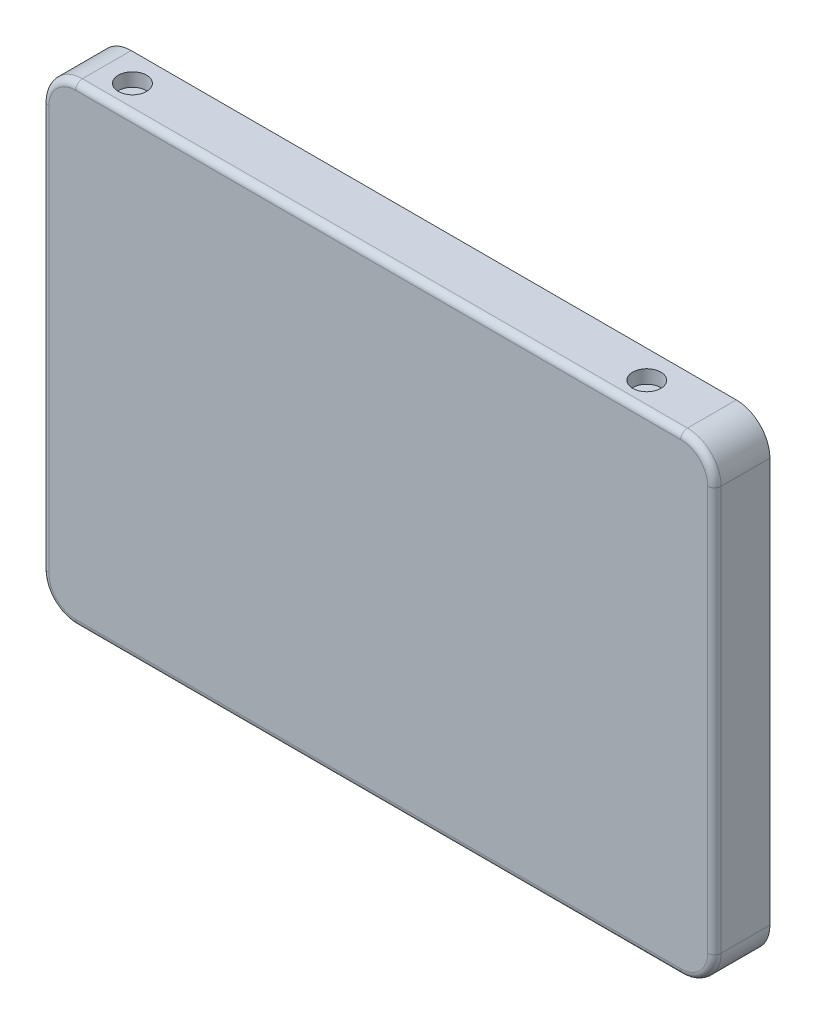
ISO-10303-21;
HEADER;
FILE_DESCRIPTION(('STEP AP214'),'2;1');
FILE_NAME('part.step','',(''),(''),'','','');
FILE_SCHEMA(('AUTOMOTIVE_DESIGN { 1 0 10303 214 1 1 1 1 }'));
ENDSEC;
DATA;
#1=APPLICATION_CONTEXT('core data for automotive mechanical design processes');
#2=APPLICATION_PROTOCOL_DEFINITION('international standard','automotive_design',2000,#1);
#3=PRODUCT_CONTEXT('',#1,'mechanical');
#4=PRODUCT('Part','Part','',(#3));
#5=PRODUCT_RELATED_PRODUCT_CATEGORY('part','',(#4));
#6=PRODUCT_DEFINITION_FORMATION('','',#4);
#7=PRODUCT_DEFINITION_CONTEXT('part definition',#1,'design');
#8=PRODUCT_DEFINITION('design','',#6,#7);
#9=PRODUCT_DEFINITION_SHAPE('','',#8);
#10=(LENGTH_UNIT() NAMED_UNIT(*) SI_UNIT(.MILLI.,.METRE.));
#11=(NAMED_UNIT(*) PLANE_ANGLE_UNIT() SI_UNIT($,.RADIAN.));
#12=(NAMED_UNIT(*) SI_UNIT($,.STERADIAN.) SOLID_ANGLE_UNIT());
#13=UNCERTAINTY_MEASURE_WITH_UNIT(LENGTH_MEASURE(1.E-05),#10,'distance_accuracy_value','');
#14=(GEOMETRIC_REPRESENTATION_CONTEXT(3) GLOBAL_UNCERTAINTY_ASSIGNED_CONTEXT((#13)) GLOBAL_UNIT_ASSIGNED_CONTEXT((#10,
#11,#12)) REPRESENTATION_CONTEXT('',''));
#15=CARTESIAN_POINT('',(0.,0.,0.));
#16=DIRECTION('',(0.,0.,1.));
#17=DIRECTION('',(1.,0.,0.));
#18=AXIS2_PLACEMENT_3D('',#15,#16,#17);
#19=CARTESIAN_POINT('',(0.,0.,0.));
#20=DIRECTION('',(0.,0.,1.));
#21=DIRECTION('',(1.,0.,0.));
#22=AXIS2_PLACEMENT_3D('',#19,#20,#21);
#23=PLANE('',#22);
#24=CARTESIAN_POINT('',(85.81,30.925,0.));
#25=DIRECTION('',(0.,0.,-1.));
#26=DIRECTION('',(-1.,0.,0.));
#27=AXIS2_PLACEMENT_3D('',#24,#25,#26);
#28=CIRCLE('',#27,2.);
#29=CARTESIAN_POINT('',(83.81,30.925,0.));
#30=VERTEX_POINT('',#29);
#31=EDGE_CURVE('E640',#30,#30,#28,.T.);
#32=ORIENTED_EDGE('',*,*,#31,.F.);
#33=EDGE_LOOP('',(#32));
#34=FACE_BOUND('',#33,.T.);
#35=CARTESIAN_POINT('',(9.31,-30.925,0.));
#36=DIRECTION('',(0.,0.,1.));
#37=DIRECTION('',(1.,0.,0.));
#38=AXIS2_PLACEMENT_3D('',#35,#36,#37);
#39=CIRCLE('',#38,2.);
#40=CARTESIAN_POINT('',(11.31,-30.925,0.));
#41=VERTEX_POINT('',#40);
#42=EDGE_CURVE('E233',#41,#41,#39,.T.);
#43=ORIENTED_EDGE('',*,*,#42,.T.);
#44=EDGE_LOOP('',(#43));
#45=FACE_BOUND('',#44,.T.);
#46=DIRECTION('',(0.,-1.,0.));
#47=VECTOR('',#46,1.);
#48=CARTESIAN_POINT('',(100.,35.075,0.));
#49=LINE('',#48,#47);
#50=CARTESIAN_POINT('',(100.,30.075,0.));
#51=VERTEX_POINT('',#50);
#52=CARTESIAN_POINT('',(100.,-30.075,0.));
#53=VERTEX_POINT('',#52);
#54=EDGE_CURVE('E128',#51,#53,#49,.T.);
#55=ORIENTED_EDGE('',*,*,#54,.T.);
#56=CARTESIAN_POINT('',(95.,-30.075,0.));
#57=DIRECTION('',(0.,0.,1.));
#58=DIRECTION('',(1.,0.,0.));
#59=AXIS2_PLACEMENT_3D('',#56,#57,#58);
#60=CIRCLE('',#59,5.);
#61=CARTESIAN_POINT('',(95.,-35.075,0.));
#62=VERTEX_POINT('',#61);
#63=EDGE_CURVE('E150',#53,#62,#60,.F.);
#64=ORIENTED_EDGE('',*,*,#63,.T.);
#65=DIRECTION('',(1.,0.,0.));
#66=VECTOR('',#65,1.);
#67=CARTESIAN_POINT('',(0.,-35.075,0.));
#68=LINE('',#67,#66);
#69=CARTESIAN_POINT('',(5.00000000000001,-35.075,0.));
#70=VERTEX_POINT('',#69);
#71=EDGE_CURVE('E141',#70,#62,#68,.T.);
#72=ORIENTED_EDGE('',*,*,#71,.F.);
#73=CARTESIAN_POINT('',(5.,-30.075,0.));
#74=DIRECTION('',(0.,0.,1.));
#75=DIRECTION('',(1.,0.,0.));
#76=AXIS2_PLACEMENT_3D('',#73,#74,#75);
#77=CIRCLE('',#76,5.);
#78=CARTESIAN_POINT('',(0.,-30.075,0.));
#79=VERTEX_POINT('',#78);
#80=EDGE_CURVE('E131',#70,#79,#77,.F.);
#81=ORIENTED_EDGE('',*,*,#80,.T.);
#82=DIRECTION('',(0.,-1.,0.));
#83=VECTOR('',#82,1.);
#84=CARTESIAN_POINT('',(0.,35.075,0.));
#85=LINE('',#84,#83);
#86=CARTESIAN_POINT('',(0.,30.075,0.));
#87=VERTEX_POINT('',#86);
#88=EDGE_CURVE('E251',#87,#79,#85,.T.);
#89=ORIENTED_EDGE('',*,*,#88,.F.);
#90=CARTESIAN_POINT('',(5.,30.075,0.));
#91=DIRECTION('',(0.,0.,1.));
#92=DIRECTION('',(1.,0.,0.));
#93=AXIS2_PLACEMENT_3D('',#90,#91,#92);
#94=CIRCLE('',#93,5.);
#95=CARTESIAN_POINT('',(5.,35.075,0.));
#96=VERTEX_POINT('',#95);
#97=EDGE_CURVE('E132',#87,#96,#94,.F.);
#98=ORIENTED_EDGE('',*,*,#97,.T.);
#99=DIRECTION('',(1.,0.,0.));
#100=VECTOR('',#99,1.);
#101=CARTESIAN_POINT('',(0.,35.075,0.));
#102=LINE('',#101,#100);
#103=CARTESIAN_POINT('',(95.,35.075,0.));
#104=VERTEX_POINT('',#103);
#105=EDGE_CURVE('E130',#96,#104,#102,.T.);
#106=ORIENTED_EDGE('',*,*,#105,.T.);
#107=CARTESIAN_POINT('',(95.,30.075,0.));
#108=DIRECTION('',(0.,0.,1.));
#109=DIRECTION('',(1.,0.,0.));
#110=AXIS2_PLACEMENT_3D('',#107,#108,#109);
#111=CIRCLE('',#110,5.);
#112=EDGE_CURVE('E125',#104,#51,#111,.F.);
#113=ORIENTED_EDGE('',*,*,#112,.T.);
#114=EDGE_LOOP('',(#55,#64,#72,#81,#89,#98,#106,#113));
#115=FACE_BOUND('',#114,.T.);
#116=CARTESIAN_POINT('',(9.31,30.925,0.));
#117=DIRECTION('',(0.,0.,1.));
#118=DIRECTION('',(1.,0.,0.));
#119=AXIS2_PLACEMENT_3D('',#116,#117,#118);
#120=CIRCLE('',#119,2.);
#121=CARTESIAN_POINT('',(11.31,30.925,0.));
#122=VERTEX_POINT('',#121);
#123=EDGE_CURVE('E652',#122,#122,#120,.T.);
#124=ORIENTED_EDGE('',*,*,#123,.T.);
#125=EDGE_LOOP('',(#124));
#126=FACE_BOUND('',#125,.T.);
#127=CARTESIAN_POINT('',(85.81,-30.925,0.));
#128=DIRECTION('',(0.,0.,-1.));
#129=DIRECTION('',(-1.,0.,0.));
#130=AXIS2_PLACEMENT_3D('',#127,#128,#129);
#131=CIRCLE('',#130,2.);
#132=CARTESIAN_POINT('',(83.81,-30.925,0.));
#133=VERTEX_POINT('',#132);
#134=EDGE_CURVE('E641',#133,#133,#131,.T.);
#135=ORIENTED_EDGE('',*,*,#134,.F.);
#136=EDGE_LOOP('',(#135));
#137=FACE_BOUND('',#136,.T.);
#138=ADVANCED_FACE('F34',(#34,#45,#115,#126,#137),#23,.F.);
#139=CARTESIAN_POINT('',(0.,35.075,8.25));
#140=DIRECTION('',(0.,1.,0.));
#141=DIRECTION('',(-1.,0.,0.));
#142=AXIS2_PLACEMENT_3D('',#139,#140,#141);
#143=PLANE('',#142);
#144=CARTESIAN_POINT('',(85.81,35.075,4.125));
#145=DIRECTION('',(0.,1.,0.));
#146=DIRECTION('',(-1.,0.,0.));
#147=AXIS2_PLACEMENT_3D('',#144,#145,#146);
#148=CIRCLE('',#147,2.1);
#149=CARTESIAN_POINT('',(83.71,35.075,4.125));
#150=VERTEX_POINT('',#149);
#151=EDGE_CURVE('E230',#150,#150,#148,.T.);
#152=ORIENTED_EDGE('',*,*,#151,.F.);
#153=EDGE_LOOP('',(#152));
#154=FACE_BOUND('',#153,.T.);
#155=DIRECTION('',(0.,0.,-1.));
#156=VECTOR('',#155,1.);
#157=CARTESIAN_POINT('',(5.,35.075,8.25));
#158=LINE('',#157,#156);
#159=CARTESIAN_POINT('',(5.,35.075,7.25));
#160=VERTEX_POINT('',#159);
#161=EDGE_CURVE('E162',#96,#160,#158,.F.);
#162=ORIENTED_EDGE('',*,*,#161,.T.);
#163=DIRECTION('',(1.,0.,0.));
#164=VECTOR('',#163,1.);
#165=CARTESIAN_POINT('',(0.,35.075,7.25));
#166=LINE('',#165,#164);
#167=CARTESIAN_POINT('',(95.,35.075,7.25));
#168=VERTEX_POINT('',#167);
#169=EDGE_CURVE('E11',#160,#168,#166,.T.);
#170=ORIENTED_EDGE('',*,*,#169,.T.);
#171=DIRECTION('',(0.,0.,-1.));
#172=VECTOR('',#171,1.);
#173=CARTESIAN_POINT('',(95.,35.075,8.25));
#174=LINE('',#173,#172);
#175=EDGE_CURVE('E164',#168,#104,#174,.T.);
#176=ORIENTED_EDGE('',*,*,#175,.T.);
#177=ORIENTED_EDGE('',*,*,#105,.F.);
#178=EDGE_LOOP('',(#162,#170,#176,#177));
#179=FACE_BOUND('',#178,.T.);
#180=CARTESIAN_POINT('',(9.31,35.075,4.125));
#181=DIRECTION('',(0.,1.,0.));
#182=DIRECTION('',(-1.,0.,0.));
#183=AXIS2_PLACEMENT_3D('',#180,#181,#182);
#184=CIRCLE('',#183,2.1);
#185=CARTESIAN_POINT('',(7.21,35.075,4.125));
#186=VERTEX_POINT('',#185);
#187=EDGE_CURVE('E220',#186,#186,#184,.T.);
#188=ORIENTED_EDGE('',*,*,#187,.F.);
#189=EDGE_LOOP('',(#188));
#190=FACE_BOUND('',#189,.T.);
#191=ADVANCED_FACE('F286',(#154,#179,#190),#143,.T.);
#192=CARTESIAN_POINT('',(0.,-35.075,8.25));
#193=DIRECTION('',(0.,1.,0.));
#194=DIRECTION('',(-1.,0.,0.));
#195=AXIS2_PLACEMENT_3D('',#192,#193,#194);
#196=PLANE('',#195);
#197=CARTESIAN_POINT('',(9.31,-35.075,4.125));
#198=DIRECTION('',(0.,1.,0.));
#199=DIRECTION('',(-1.,0.,0.));
#200=AXIS2_PLACEMENT_3D('',#197,#198,#199);
#201=CIRCLE('',#200,2.1);
#202=CARTESIAN_POINT('',(7.21,-35.075,4.125));
#203=VERTEX_POINT('',#202);
#204=EDGE_CURVE('E245',#203,#203,#201,.T.);
#205=ORIENTED_EDGE('',*,*,#204,.T.);
#206=EDGE_LOOP('',(#205));
#207=FACE_BOUND('',#206,.T.);
#208=DIRECTION('',(0.,0.,-1.));
#209=VECTOR('',#208,1.);
#210=CARTESIAN_POINT('',(95.,-35.075,8.25));
#211=LINE('',#210,#209);
#212=CARTESIAN_POINT('',(95.,-35.075,7.25));
#213=VERTEX_POINT('',#212);
#214=EDGE_CURVE('E154',#62,#213,#211,.F.);
#215=ORIENTED_EDGE('',*,*,#214,.T.);
#216=DIRECTION('',(1.,0.,0.));
#217=VECTOR('',#216,1.);
#218=CARTESIAN_POINT('',(5.00000000000001,-35.075,7.25));
#219=LINE('',#218,#217);
#220=CARTESIAN_POINT('',(5.00000000000001,-35.075,7.25));
#221=VERTEX_POINT('',#220);
#222=EDGE_CURVE('E190',#213,#221,#219,.F.);
#223=ORIENTED_EDGE('',*,*,#222,.T.);
#224=DIRECTION('',(0.,0.,-1.));
#225=VECTOR('',#224,1.);
#226=CARTESIAN_POINT('',(5.00000000000001,-35.075,8.25));
#227=LINE('',#226,#225);
#228=EDGE_CURVE('E152',#221,#70,#227,.T.);
#229=ORIENTED_EDGE('',*,*,#228,.T.);
#230=ORIENTED_EDGE('',*,*,#71,.T.);
#231=EDGE_LOOP('',(#215,#223,#229,#230));
#232=FACE_BOUND('',#231,.T.);
#233=CARTESIAN_POINT('',(85.81,-35.075,4.125));
#234=DIRECTION('',(0.,1.,0.));
#235=DIRECTION('',(-1.,0.,0.));
#236=AXIS2_PLACEMENT_3D('',#233,#234,#235);
#237=CIRCLE('',#236,2.1);
#238=CARTESIAN_POINT('',(83.71,-35.075,4.125));
#239=VERTEX_POINT('',#238);
#240=EDGE_CURVE('E242',#239,#239,#237,.T.);
#241=ORIENTED_EDGE('',*,*,#240,.T.);
#242=EDGE_LOOP('',(#241));
#243=FACE_BOUND('',#242,.T.);
#244=ADVANCED_FACE('F260',(#207,#232,#243),#196,.F.);
#245=CARTESIAN_POINT('',(0.,35.075,8.25));
#246=DIRECTION('',(1.,0.,0.));
#247=DIRECTION('',(0.,1.,0.));
#248=AXIS2_PLACEMENT_3D('',#245,#246,#247);
#249=PLANE('',#248);
#250=DIRECTION('',(0.,0.,-1.));
#251=VECTOR('',#250,1.);
#252=CARTESIAN_POINT('',(0.,-30.075,8.25));
#253=LINE('',#252,#251);
#254=CARTESIAN_POINT('',(0.,-30.075,7.25));
#255=VERTEX_POINT('',#254);
#256=EDGE_CURVE('E159',#79,#255,#253,.F.);
#257=ORIENTED_EDGE('',*,*,#256,.T.);
#258=DIRECTION('',(0.,-1.,0.));
#259=VECTOR('',#258,1.);
#260=CARTESIAN_POINT('',(0.,30.075,7.25));
#261=LINE('',#260,#259);
#262=CARTESIAN_POINT('',(0.,30.075,7.25));
#263=VERTEX_POINT('',#262);
#264=EDGE_CURVE('E186',#255,#263,#261,.F.);
#265=ORIENTED_EDGE('',*,*,#264,.T.);
#266=DIRECTION('',(0.,0.,-1.));
#267=VECTOR('',#266,1.);
#268=CARTESIAN_POINT('',(0.,30.075,0.));
#269=LINE('',#268,#267);
#270=EDGE_CURVE('E157',#263,#87,#269,.T.);
#271=ORIENTED_EDGE('',*,*,#270,.T.);
#272=ORIENTED_EDGE('',*,*,#88,.T.);
#273=EDGE_LOOP('',(#257,#265,#271,#272));
#274=FACE_BOUND('',#273,.T.);
#275=ADVANCED_FACE('F277',(#274),#249,.F.);
#276=CARTESIAN_POINT('',(100.,35.075,8.25));
#277=DIRECTION('',(1.,0.,0.));
#278=DIRECTION('',(0.,1.,0.));
#279=AXIS2_PLACEMENT_3D('',#276,#277,#278);
#280=PLANE('',#279);
#281=DIRECTION('',(0.,0.,-1.));
#282=VECTOR('',#281,1.);
#283=CARTESIAN_POINT('',(100.,30.075,8.25));
#284=LINE('',#283,#282);
#285=CARTESIAN_POINT('',(100.,30.075,7.25));
#286=VERTEX_POINT('',#285);
#287=EDGE_CURVE('E136',#51,#286,#284,.F.);
#288=ORIENTED_EDGE('',*,*,#287,.T.);
#289=DIRECTION('',(0.,-1.,0.));
#290=VECTOR('',#289,1.);
#291=CARTESIAN_POINT('',(100.,35.075,7.25));
#292=LINE('',#291,#290);
#293=CARTESIAN_POINT('',(100.,-30.075,7.25));
#294=VERTEX_POINT('',#293);
#295=EDGE_CURVE('E194',#286,#294,#292,.T.);
#296=ORIENTED_EDGE('',*,*,#295,.T.);
#297=DIRECTION('',(0.,0.,-1.));
#298=VECTOR('',#297,1.);
#299=CARTESIAN_POINT('',(100.,-30.075,0.));
#300=LINE('',#299,#298);
#301=EDGE_CURVE('E139',#294,#53,#300,.T.);
#302=ORIENTED_EDGE('',*,*,#301,.T.);
#303=ORIENTED_EDGE('',*,*,#54,.F.);
#304=EDGE_LOOP('',(#288,#296,#302,#303));
#305=FACE_BOUND('',#304,.T.);
#306=ADVANCED_FACE('F135',(#305),#280,.T.);
#307=CARTESIAN_POINT('',(0.,0.,8.25));
#308=DIRECTION('',(0.,0.,1.));
#309=DIRECTION('',(1.,0.,0.));
#310=AXIS2_PLACEMENT_3D('',#307,#308,#309);
#311=PLANE('',#310);
#312=DIRECTION('',(1.,0.,0.));
#313=VECTOR('',#312,1.);
#314=CARTESIAN_POINT('',(0.,34.075,8.25));
#315=LINE('',#314,#313);
#316=CARTESIAN_POINT('',(95.,34.075,8.25));
#317=VERTEX_POINT('',#316);
#318=CARTESIAN_POINT('',(5.,34.075,8.25));
#319=VERTEX_POINT('',#318);
#320=EDGE_CURVE('E166',#317,#319,#315,.F.);
#321=ORIENTED_EDGE('',*,*,#320,.T.);
#322=CARTESIAN_POINT('',(5.,30.075,8.25));
#323=DIRECTION('',(0.,0.,1.));
#324=DIRECTION('',(1.,0.,0.));
#325=AXIS2_PLACEMENT_3D('',#322,#323,#324);
#326=CIRCLE('',#325,4.);
#327=CARTESIAN_POINT('',(1.,30.075,8.25));
#328=VERTEX_POINT('',#327);
#329=EDGE_CURVE('E180',#319,#328,#326,.T.);
#330=ORIENTED_EDGE('',*,*,#329,.T.);
#331=DIRECTION('',(0.,-1.,0.));
#332=VECTOR('',#331,1.);
#333=CARTESIAN_POINT('',(1.,-30.075,8.25));
#334=LINE('',#333,#332);
#335=CARTESIAN_POINT('',(1.,-30.075,8.25));
#336=VERTEX_POINT('',#335);
#337=EDGE_CURVE('E178',#328,#336,#334,.T.);
#338=ORIENTED_EDGE('',*,*,#337,.T.);
#339=CARTESIAN_POINT('',(5.,-30.075,8.25));
#340=DIRECTION('',(0.,0.,1.));
#341=DIRECTION('',(1.,0.,0.));
#342=AXIS2_PLACEMENT_3D('',#339,#340,#341);
#343=CIRCLE('',#342,4.);
#344=CARTESIAN_POINT('',(5.00000000000001,-34.075,8.25));
#345=VERTEX_POINT('',#344);
#346=EDGE_CURVE('E176',#336,#345,#343,.T.);
#347=ORIENTED_EDGE('',*,*,#346,.T.);
#348=DIRECTION('',(1.,0.,0.));
#349=VECTOR('',#348,1.);
#350=CARTESIAN_POINT('',(95.,-34.075,8.25));
#351=LINE('',#350,#349);
#352=CARTESIAN_POINT('',(95.,-34.075,8.25));
#353=VERTEX_POINT('',#352);
#354=EDGE_CURVE('E174',#345,#353,#351,.T.);
#355=ORIENTED_EDGE('',*,*,#354,.T.);
#356=CARTESIAN_POINT('',(95.,-30.075,8.25));
#357=DIRECTION('',(0.,0.,1.));
#358=DIRECTION('',(1.,0.,0.));
#359=AXIS2_PLACEMENT_3D('',#356,#357,#358);
#360=CIRCLE('',#359,4.);
#361=CARTESIAN_POINT('',(99.,-30.075,8.25));
#362=VERTEX_POINT('',#361);
#363=EDGE_CURVE('E172',#353,#362,#360,.T.);
#364=ORIENTED_EDGE('',*,*,#363,.T.);
#365=DIRECTION('',(0.,-1.,0.));
#366=VECTOR('',#365,1.);
#367=CARTESIAN_POINT('',(99.,0.,8.25));
#368=LINE('',#367,#366);
#369=CARTESIAN_POINT('',(99.,30.075,8.25));
#370=VERTEX_POINT('',#369);
#371=EDGE_CURVE('E170',#362,#370,#368,.F.);
#372=ORIENTED_EDGE('',*,*,#371,.T.);
#373=CARTESIAN_POINT('',(95.,30.075,8.25));
#374=DIRECTION('',(0.,0.,1.));
#375=DIRECTION('',(1.,0.,0.));
#376=AXIS2_PLACEMENT_3D('',#373,#374,#375);
#377=CIRCLE('',#376,4.);
#378=EDGE_CURVE('E168',#370,#317,#377,.T.);
#379=ORIENTED_EDGE('',*,*,#378,.T.);
#380=EDGE_LOOP('',(#321,#330,#338,#347,#355,#364,#372,#379));
#381=FACE_BOUND('',#380,.T.);
#382=ADVANCED_FACE('F299',(#381),#311,.T.);
#383=CARTESIAN_POINT('',(95.,-30.075,8.25));
#384=DIRECTION('',(0.,0.,1.));
#385=DIRECTION('',(1.,0.,0.));
#386=AXIS2_PLACEMENT_3D('',#383,#384,#385);
#387=CYLINDRICAL_SURFACE('',#386,5.);
#388=ORIENTED_EDGE('',*,*,#301,.F.);
#389=CARTESIAN_POINT('',(95.,-30.075,7.25));
#390=DIRECTION('',(0.,0.,1.));
#391=DIRECTION('',(1.,0.,0.));
#392=AXIS2_PLACEMENT_3D('',#389,#390,#391);
#393=CIRCLE('',#392,5.);
#394=EDGE_CURVE('E192',#294,#213,#393,.F.);
#395=ORIENTED_EDGE('',*,*,#394,.T.);
#396=ORIENTED_EDGE('',*,*,#214,.F.);
#397=ORIENTED_EDGE('',*,*,#63,.F.);
#398=EDGE_LOOP('',(#388,#395,#396,#397));
#399=FACE_BOUND('',#398,.T.);
#400=ADVANCED_FACE('F265',(#399),#387,.T.);
#401=CARTESIAN_POINT('',(5.,-30.075,8.25));
#402=DIRECTION('',(0.,0.,-1.));
#403=DIRECTION('',(-1.,0.,0.));
#404=AXIS2_PLACEMENT_3D('',#401,#402,#403);
#405=CYLINDRICAL_SURFACE('',#404,5.);
#406=ORIENTED_EDGE('',*,*,#228,.F.);
#407=CARTESIAN_POINT('',(5.,-30.075,7.25));
#408=DIRECTION('',(0.,0.,1.));
#409=DIRECTION('',(1.,0.,0.));
#410=AXIS2_PLACEMENT_3D('',#407,#408,#409);
#411=CIRCLE('',#410,5.);
#412=EDGE_CURVE('E188',#221,#255,#411,.F.);
#413=ORIENTED_EDGE('',*,*,#412,.T.);
#414=ORIENTED_EDGE('',*,*,#256,.F.);
#415=ORIENTED_EDGE('',*,*,#80,.F.);
#416=EDGE_LOOP('',(#406,#413,#414,#415));
#417=FACE_BOUND('',#416,.T.);
#418=ADVANCED_FACE('F273',(#417),#405,.T.);
#419=CARTESIAN_POINT('',(95.,30.075,8.25));
#420=DIRECTION('',(0.,0.,-1.));
#421=DIRECTION('',(-1.,0.,0.));
#422=AXIS2_PLACEMENT_3D('',#419,#420,#421);
#423=CYLINDRICAL_SURFACE('',#422,5.);
#424=ORIENTED_EDGE('',*,*,#175,.F.);
#425=CARTESIAN_POINT('',(95.,30.075,7.25));
#426=DIRECTION('',(0.,0.,1.));
#427=DIRECTION('',(1.,0.,0.));
#428=AXIS2_PLACEMENT_3D('',#425,#426,#427);
#429=CIRCLE('',#428,5.);
#430=EDGE_CURVE('E43',#168,#286,#429,.F.);
#431=ORIENTED_EDGE('',*,*,#430,.T.);
#432=ORIENTED_EDGE('',*,*,#287,.F.);
#433=ORIENTED_EDGE('',*,*,#112,.F.);
#434=EDGE_LOOP('',(#424,#431,#432,#433));
#435=FACE_BOUND('',#434,.T.);
#436=ADVANCED_FACE('F143',(#435),#423,.T.);
#437=CARTESIAN_POINT('',(5.,30.075,8.25));
#438=DIRECTION('',(0.,0.,1.));
#439=DIRECTION('',(1.,0.,0.));
#440=AXIS2_PLACEMENT_3D('',#437,#438,#439);
#441=CYLINDRICAL_SURFACE('',#440,5.);
#442=ORIENTED_EDGE('',*,*,#270,.F.);
#443=CARTESIAN_POINT('',(5.,30.075,7.25));
#444=DIRECTION('',(0.,0.,1.));
#445=DIRECTION('',(1.,0.,0.));
#446=AXIS2_PLACEMENT_3D('',#443,#444,#445);
#447=CIRCLE('',#446,5.);
#448=EDGE_CURVE('E183',#263,#160,#447,.F.);
#449=ORIENTED_EDGE('',*,*,#448,.T.);
#450=ORIENTED_EDGE('',*,*,#161,.F.);
#451=ORIENTED_EDGE('',*,*,#97,.F.);
#452=EDGE_LOOP('',(#442,#449,#450,#451));
#453=FACE_BOUND('',#452,.T.);
#454=ADVANCED_FACE('F285',(#453),#441,.T.);
#455=CARTESIAN_POINT('',(9.31,-33.075,4.125));
#456=DIRECTION('',(0.,-1.,0.));
#457=DIRECTION('',(0.,0.,-1.));
#458=AXIS2_PLACEMENT_3D('',#455,#456,#457);
#459=CYLINDRICAL_SURFACE('',#458,2.1);
#460=CARTESIAN_POINT('',(9.31,-33.075,4.125));
#461=DIRECTION('',(0.,1.,0.));
#462=DIRECTION('',(-1.,0.,0.));
#463=AXIS2_PLACEMENT_3D('',#460,#461,#462);
#464=CIRCLE('',#463,2.1);
#465=CARTESIAN_POINT('',(7.21,-33.075,4.125));
#466=VERTEX_POINT('',#465);
#467=EDGE_CURVE('E248',#466,#466,#464,.T.);
#468=ORIENTED_EDGE('',*,*,#467,.T.);
#469=EDGE_LOOP('',(#468));
#470=FACE_BOUND('',#469,.T.);
#471=ORIENTED_EDGE('',*,*,#204,.F.);
#472=EDGE_LOOP('',(#471));
#473=FACE_BOUND('',#472,.T.);
#474=ADVANCED_FACE('F336',(#470,#473),#459,.F.);
#475=CARTESIAN_POINT('',(9.31,-33.075,4.125));
#476=DIRECTION('',(0.,1.,0.));
#477=DIRECTION('',(-1.,0.,0.));
#478=AXIS2_PLACEMENT_3D('',#475,#476,#477);
#479=PLANE('',#478);
#480=ORIENTED_EDGE('',*,*,#467,.F.);
#481=EDGE_LOOP('',(#480));
#482=FACE_BOUND('',#481,.T.);
#483=ADVANCED_FACE('F539',(#482),#479,.F.);
#484=CARTESIAN_POINT('',(85.81,-33.075,4.125));
#485=DIRECTION('',(0.,-1.,0.));
#486=DIRECTION('',(0.,0.,-1.));
#487=AXIS2_PLACEMENT_3D('',#484,#485,#486);
#488=CYLINDRICAL_SURFACE('',#487,2.1);
#489=CARTESIAN_POINT('',(85.81,-33.075,4.125));
#490=DIRECTION('',(0.,1.,0.));
#491=DIRECTION('',(-1.,0.,0.));
#492=AXIS2_PLACEMENT_3D('',#489,#490,#491);
#493=CIRCLE('',#492,2.1);
#494=CARTESIAN_POINT('',(83.71,-33.075,4.125));
#495=VERTEX_POINT('',#494);
#496=EDGE_CURVE('E241',#495,#495,#493,.T.);
#497=ORIENTED_EDGE('',*,*,#496,.T.);
#498=EDGE_LOOP('',(#497));
#499=FACE_BOUND('',#498,.T.);
#500=ORIENTED_EDGE('',*,*,#240,.F.);
#501=EDGE_LOOP('',(#500));
#502=FACE_BOUND('',#501,.T.);
#503=ADVANCED_FACE('F530',(#499,#502),#488,.F.);
#504=CARTESIAN_POINT('',(85.81,-33.075,4.125));
#505=DIRECTION('',(0.,1.,0.));
#506=DIRECTION('',(-1.,0.,0.));
#507=AXIS2_PLACEMENT_3D('',#504,#505,#506);
#508=PLANE('',#507);
#509=ORIENTED_EDGE('',*,*,#496,.F.);
#510=EDGE_LOOP('',(#509));
#511=FACE_BOUND('',#510,.T.);
#512=ADVANCED_FACE('F516',(#511),#508,.F.);
#513=CARTESIAN_POINT('',(85.81,33.075,4.125));
#514=DIRECTION('',(0.,1.,0.));
#515=DIRECTION('',(0.,0.,-1.));
#516=AXIS2_PLACEMENT_3D('',#513,#514,#515);
#517=CYLINDRICAL_SURFACE('',#516,2.1);
#518=CARTESIAN_POINT('',(85.81,33.075,4.125));
#519=DIRECTION('',(0.,1.,0.));
#520=DIRECTION('',(-1.,0.,0.));
#521=AXIS2_PLACEMENT_3D('',#518,#519,#520);
#522=CIRCLE('',#521,2.1);
#523=CARTESIAN_POINT('',(83.71,33.075,4.125));
#524=VERTEX_POINT('',#523);
#525=EDGE_CURVE('E238',#524,#524,#522,.T.);
#526=ORIENTED_EDGE('',*,*,#525,.F.);
#527=EDGE_LOOP('',(#526));
#528=FACE_BOUND('',#527,.T.);
#529=ORIENTED_EDGE('',*,*,#151,.T.);
#530=EDGE_LOOP('',(#529));
#531=FACE_BOUND('',#530,.T.);
#532=ADVANCED_FACE('F507',(#528,#531),#517,.F.);
#533=CARTESIAN_POINT('',(85.81,33.075,4.125));
#534=DIRECTION('',(0.,-1.,0.));
#535=DIRECTION('',(-1.,0.,0.));
#536=AXIS2_PLACEMENT_3D('',#533,#534,#535);
#537=PLANE('',#536);
#538=ORIENTED_EDGE('',*,*,#525,.T.);
#539=EDGE_LOOP('',(#538));
#540=FACE_BOUND('',#539,.T.);
#541=ADVANCED_FACE('F498',(#540),#537,.F.);
#542=CARTESIAN_POINT('',(9.31,33.075,4.125));
#543=DIRECTION('',(0.,1.,0.));
#544=DIRECTION('',(0.,0.,-1.));
#545=AXIS2_PLACEMENT_3D('',#542,#543,#544);
#546=CYLINDRICAL_SURFACE('',#545,2.1);
#547=CARTESIAN_POINT('',(9.31,33.075,4.125));
#548=DIRECTION('',(0.,1.,0.));
#549=DIRECTION('',(-1.,0.,0.));
#550=AXIS2_PLACEMENT_3D('',#547,#548,#549);
#551=CIRCLE('',#550,2.1);
#552=CARTESIAN_POINT('',(7.21,33.075,4.125));
#553=VERTEX_POINT('',#552);
#554=EDGE_CURVE('E225',#553,#553,#551,.T.);
#555=ORIENTED_EDGE('',*,*,#554,.F.);
#556=EDGE_LOOP('',(#555));
#557=FACE_BOUND('',#556,.T.);
#558=ORIENTED_EDGE('',*,*,#187,.T.);
#559=EDGE_LOOP('',(#558));
#560=FACE_BOUND('',#559,.T.);
#561=ADVANCED_FACE('F488',(#557,#560),#546,.F.);
#562=CARTESIAN_POINT('',(9.31,33.075,4.125));
#563=DIRECTION('',(0.,-1.,0.));
#564=DIRECTION('',(-1.,0.,0.));
#565=AXIS2_PLACEMENT_3D('',#562,#563,#564);
#566=PLANE('',#565);
#567=ORIENTED_EDGE('',*,*,#554,.T.);
#568=EDGE_LOOP('',(#567));
#569=FACE_BOUND('',#568,.T.);
#570=ADVANCED_FACE('F307',(#569),#566,.F.);
#571=CARTESIAN_POINT('',(95.,-30.075,7.25));
#572=DIRECTION('',(0.,0.,1.));
#573=DIRECTION('',(1.,0.,0.));
#574=AXIS2_PLACEMENT_3D('',#571,#572,#573);
#575=TOROIDAL_SURFACE('',#574,4.,1.);
#576=CARTESIAN_POINT('',(95.,-34.075,7.25));
#577=DIRECTION('',(-1.,0.,0.));
#578=DIRECTION('',(0.,0.,1.));
#579=AXIS2_PLACEMENT_3D('',#576,#577,#578);
#580=CIRCLE('',#579,1.);
#581=EDGE_CURVE('E213',#213,#353,#580,.T.);
#582=ORIENTED_EDGE('',*,*,#581,.F.);
#583=ORIENTED_EDGE('',*,*,#394,.F.);
#584=CARTESIAN_POINT('',(99.,-30.075,7.25));
#585=DIRECTION('',(0.,1.,0.));
#586=DIRECTION('',(0.,0.,1.));
#587=AXIS2_PLACEMENT_3D('',#584,#585,#586);
#588=CIRCLE('',#587,1.);
#589=EDGE_CURVE('E38',#362,#294,#588,.T.);
#590=ORIENTED_EDGE('',*,*,#589,.F.);
#591=ORIENTED_EDGE('',*,*,#363,.F.);
#592=EDGE_LOOP('',(#582,#583,#590,#591));
#593=FACE_BOUND('',#592,.T.);
#594=ADVANCED_FACE('F36',(#593),#575,.T.);
#595=CARTESIAN_POINT('',(99.,35.075,7.25));
#596=DIRECTION('',(0.,-1.,0.));
#597=DIRECTION('',(1.,0.,0.));
#598=AXIS2_PLACEMENT_3D('',#595,#596,#597);
#599=CYLINDRICAL_SURFACE('',#598,1.);
#600=ORIENTED_EDGE('',*,*,#589,.T.);
#601=ORIENTED_EDGE('',*,*,#295,.F.);
#602=CARTESIAN_POINT('',(99.,30.075,7.25));
#603=DIRECTION('',(0.,1.,0.));
#604=DIRECTION('',(0.,0.,1.));
#605=AXIS2_PLACEMENT_3D('',#602,#603,#604);
#606=CIRCLE('',#605,1.);
#607=EDGE_CURVE('E211',#370,#286,#606,.T.);
#608=ORIENTED_EDGE('',*,*,#607,.F.);
#609=ORIENTED_EDGE('',*,*,#371,.F.);
#610=EDGE_LOOP('',(#600,#601,#608,#609));
#611=FACE_BOUND('',#610,.T.);
#612=ADVANCED_FACE('F300',(#611),#599,.T.);
#613=CARTESIAN_POINT('',(0.,-34.075,7.25));
#614=DIRECTION('',(-1.,0.,0.));
#615=DIRECTION('',(0.,-1.,0.));
#616=AXIS2_PLACEMENT_3D('',#613,#614,#615);
#617=CYLINDRICAL_SURFACE('',#616,1.);
#618=ORIENTED_EDGE('',*,*,#581,.T.);
#619=ORIENTED_EDGE('',*,*,#354,.F.);
#620=CARTESIAN_POINT('',(5.00000000000001,-34.075,7.25));
#621=DIRECTION('',(-1.,0.,0.));
#622=DIRECTION('',(0.,0.,1.));
#623=AXIS2_PLACEMENT_3D('',#620,#621,#622);
#624=CIRCLE('',#623,1.);
#625=EDGE_CURVE('E208',#221,#345,#624,.T.);
#626=ORIENTED_EDGE('',*,*,#625,.F.);
#627=ORIENTED_EDGE('',*,*,#222,.F.);
#628=EDGE_LOOP('',(#618,#619,#626,#627));
#629=FACE_BOUND('',#628,.T.);
#630=ADVANCED_FACE('F270',(#629),#617,.T.);
#631=CARTESIAN_POINT('',(95.,30.075,7.25));
#632=DIRECTION('',(0.,0.,1.));
#633=DIRECTION('',(1.,0.,0.));
#634=AXIS2_PLACEMENT_3D('',#631,#632,#633);
#635=TOROIDAL_SURFACE('',#634,4.,1.);
#636=ORIENTED_EDGE('',*,*,#607,.T.);
#637=ORIENTED_EDGE('',*,*,#430,.F.);
#638=CARTESIAN_POINT('',(95.,34.075,7.25));
#639=DIRECTION('',(-1.,0.,0.));
#640=DIRECTION('',(0.,0.,1.));
#641=AXIS2_PLACEMENT_3D('',#638,#639,#640);
#642=CIRCLE('',#641,1.);
#643=EDGE_CURVE('E205',#317,#168,#642,.T.);
#644=ORIENTED_EDGE('',*,*,#643,.F.);
#645=ORIENTED_EDGE('',*,*,#378,.F.);
#646=EDGE_LOOP('',(#636,#637,#644,#645));
#647=FACE_BOUND('',#646,.T.);
#648=ADVANCED_FACE('F290',(#647),#635,.T.);
#649=CARTESIAN_POINT('',(5.,-30.075,7.25));
#650=DIRECTION('',(0.,0.,1.));
#651=DIRECTION('',(1.,0.,0.));
#652=AXIS2_PLACEMENT_3D('',#649,#650,#651);
#653=TOROIDAL_SURFACE('',#652,4.,1.);
#654=ORIENTED_EDGE('',*,*,#625,.T.);
#655=ORIENTED_EDGE('',*,*,#346,.F.);
#656=CARTESIAN_POINT('',(1.,-30.075,7.25));
#657=DIRECTION('',(0.,1.,0.));
#658=DIRECTION('',(0.,0.,1.));
#659=AXIS2_PLACEMENT_3D('',#656,#657,#658);
#660=CIRCLE('',#659,1.);
#661=EDGE_CURVE('E202',#255,#336,#660,.T.);
#662=ORIENTED_EDGE('',*,*,#661,.F.);
#663=ORIENTED_EDGE('',*,*,#412,.F.);
#664=EDGE_LOOP('',(#654,#655,#662,#663));
#665=FACE_BOUND('',#664,.T.);
#666=ADVANCED_FACE('F348',(#665),#653,.T.);
#667=CARTESIAN_POINT('',(0.,34.075,7.25));
#668=DIRECTION('',(1.,0.,0.));
#669=DIRECTION('',(0.,1.,0.));
#670=AXIS2_PLACEMENT_3D('',#667,#668,#669);
#671=CYLINDRICAL_SURFACE('',#670,1.);
#672=ORIENTED_EDGE('',*,*,#643,.T.);
#673=ORIENTED_EDGE('',*,*,#169,.F.);
#674=CARTESIAN_POINT('',(5.,34.075,7.25));
#675=DIRECTION('',(-1.,0.,0.));
#676=DIRECTION('',(0.,0.,1.));
#677=AXIS2_PLACEMENT_3D('',#674,#675,#676);
#678=CIRCLE('',#677,1.);
#679=EDGE_CURVE('E199',#319,#160,#678,.T.);
#680=ORIENTED_EDGE('',*,*,#679,.F.);
#681=ORIENTED_EDGE('',*,*,#320,.F.);
#682=EDGE_LOOP('',(#672,#673,#680,#681));
#683=FACE_BOUND('',#682,.T.);
#684=ADVANCED_FACE('F295',(#683),#671,.T.);
#685=CARTESIAN_POINT('',(1.,0.,7.25));
#686=DIRECTION('',(0.,1.,0.));
#687=DIRECTION('',(-1.,0.,0.));
#688=AXIS2_PLACEMENT_3D('',#685,#686,#687);
#689=CYLINDRICAL_SURFACE('',#688,1.);
#690=ORIENTED_EDGE('',*,*,#661,.T.);
#691=ORIENTED_EDGE('',*,*,#337,.F.);
#692=CARTESIAN_POINT('',(1.,30.075,7.25));
#693=DIRECTION('',(0.,1.,0.));
#694=DIRECTION('',(0.,0.,1.));
#695=AXIS2_PLACEMENT_3D('',#692,#693,#694);
#696=CIRCLE('',#695,1.);
#697=EDGE_CURVE('E197',#263,#328,#696,.T.);
#698=ORIENTED_EDGE('',*,*,#697,.F.);
#699=ORIENTED_EDGE('',*,*,#264,.F.);
#700=EDGE_LOOP('',(#690,#691,#698,#699));
#701=FACE_BOUND('',#700,.T.);
#702=ADVANCED_FACE('F341',(#701),#689,.T.);
#703=CARTESIAN_POINT('',(5.,30.075,7.25));
#704=DIRECTION('',(0.,0.,1.));
#705=DIRECTION('',(1.,0.,0.));
#706=AXIS2_PLACEMENT_3D('',#703,#704,#705);
#707=TOROIDAL_SURFACE('',#706,4.,1.);
#708=ORIENTED_EDGE('',*,*,#679,.T.);
#709=ORIENTED_EDGE('',*,*,#448,.F.);
#710=ORIENTED_EDGE('',*,*,#697,.T.);
#711=ORIENTED_EDGE('',*,*,#329,.F.);
#712=EDGE_LOOP('',(#708,#709,#710,#711));
#713=FACE_BOUND('',#712,.T.);
#714=ADVANCED_FACE('F337',(#713),#707,.T.);
#715=CARTESIAN_POINT('',(9.31,-30.925,2.));
#716=DIRECTION('',(0.,0.,-1.));
#717=DIRECTION('',(-1.,0.,0.));
#718=AXIS2_PLACEMENT_3D('',#715,#716,#717);
#719=CYLINDRICAL_SURFACE('',#718,2.);
#720=CARTESIAN_POINT('',(9.31,-30.925,2.));
#721=DIRECTION('',(0.,0.,1.));
#722=DIRECTION('',(1.,0.,0.));
#723=AXIS2_PLACEMENT_3D('',#720,#721,#722);
#724=CIRCLE('',#723,2.);
#725=CARTESIAN_POINT('',(11.31,-30.925,2.));
#726=VERTEX_POINT('',#725);
#727=EDGE_CURVE('E200',#726,#726,#724,.T.);
#728=ORIENTED_EDGE('',*,*,#727,.T.);
#729=EDGE_LOOP('',(#728));
#730=FACE_BOUND('',#729,.T.);
#731=ORIENTED_EDGE('',*,*,#42,.F.);
#732=EDGE_LOOP('',(#731));
#733=FACE_BOUND('',#732,.T.);
#734=ADVANCED_FACE('F340',(#730,#733),#719,.F.);
#735=CARTESIAN_POINT('',(9.31,-30.925,2.));
#736=DIRECTION('',(0.,0.,1.));
#737=DIRECTION('',(1.,0.,0.));
#738=AXIS2_PLACEMENT_3D('',#735,#736,#737);
#739=PLANE('',#738);
#740=ORIENTED_EDGE('',*,*,#727,.F.);
#741=EDGE_LOOP('',(#740));
#742=FACE_BOUND('',#741,.T.);
#743=ADVANCED_FACE('F379',(#742),#739,.F.);
#744=CARTESIAN_POINT('',(9.31,30.925,2.));
#745=DIRECTION('',(0.,0.,-1.));
#746=DIRECTION('',(-1.,0.,0.));
#747=AXIS2_PLACEMENT_3D('',#744,#745,#746);
#748=CYLINDRICAL_SURFACE('',#747,2.);
#749=CARTESIAN_POINT('',(9.31,30.925,2.));
#750=DIRECTION('',(0.,0.,1.));
#751=DIRECTION('',(1.,0.,0.));
#752=AXIS2_PLACEMENT_3D('',#749,#750,#751);
#753=CIRCLE('',#752,2.);
#754=CARTESIAN_POINT('',(11.31,30.925,2.));
#755=VERTEX_POINT('',#754);
#756=EDGE_CURVE('E651',#755,#755,#753,.T.);
#757=ORIENTED_EDGE('',*,*,#756,.T.);
#758=EDGE_LOOP('',(#757));
#759=FACE_BOUND('',#758,.T.);
#760=ORIENTED_EDGE('',*,*,#123,.F.);
#761=EDGE_LOOP('',(#760));
#762=FACE_BOUND('',#761,.T.);
#763=ADVANCED_FACE('F387',(#759,#762),#748,.F.);
#764=CARTESIAN_POINT('',(9.31,30.925,2.));
#765=DIRECTION('',(0.,0.,1.));
#766=DIRECTION('',(1.,0.,0.));
#767=AXIS2_PLACEMENT_3D('',#764,#765,#766);
#768=PLANE('',#767);
#769=ORIENTED_EDGE('',*,*,#756,.F.);
#770=EDGE_LOOP('',(#769));
#771=FACE_BOUND('',#770,.T.);
#772=ADVANCED_FACE('F395',(#771),#768,.F.);
#773=CARTESIAN_POINT('',(85.81,30.925,2.));
#774=DIRECTION('',(0.,0.,-1.));
#775=DIRECTION('',(1.,0.,0.));
#776=AXIS2_PLACEMENT_3D('',#773,#774,#775);
#777=CYLINDRICAL_SURFACE('',#776,2.);
#778=CARTESIAN_POINT('',(85.81,30.925,2.));
#779=DIRECTION('',(0.,0.,-1.));
#780=DIRECTION('',(-1.,0.,0.));
#781=AXIS2_PLACEMENT_3D('',#778,#779,#780);
#782=CIRCLE('',#781,2.);
#783=CARTESIAN_POINT('',(83.81,30.925,2.));
#784=VERTEX_POINT('',#783);
#785=EDGE_CURVE('E644',#784,#784,#782,.T.);
#786=ORIENTED_EDGE('',*,*,#785,.F.);
#787=EDGE_LOOP('',(#786));
#788=FACE_BOUND('',#787,.T.);
#789=ORIENTED_EDGE('',*,*,#31,.T.);
#790=EDGE_LOOP('',(#789));
#791=FACE_BOUND('',#790,.T.);
#792=ADVANCED_FACE('F403',(#788,#791),#777,.F.);
#793=CARTESIAN_POINT('',(85.81,30.925,2.));
#794=DIRECTION('',(0.,0.,1.));
#795=DIRECTION('',(-1.,0.,0.));
#796=AXIS2_PLACEMENT_3D('',#793,#794,#795);
#797=PLANE('',#796);
#798=ORIENTED_EDGE('',*,*,#785,.T.);
#799=EDGE_LOOP('',(#798));
#800=FACE_BOUND('',#799,.T.);
#801=ADVANCED_FACE('F411',(#800),#797,.F.);
#802=CARTESIAN_POINT('',(85.81,-30.925,2.));
#803=DIRECTION('',(0.,0.,-1.));
#804=DIRECTION('',(1.,0.,0.));
#805=AXIS2_PLACEMENT_3D('',#802,#803,#804);
#806=CYLINDRICAL_SURFACE('',#805,2.);
#807=CARTESIAN_POINT('',(85.81,-30.925,2.));
#808=DIRECTION('',(0.,0.,-1.));
#809=DIRECTION('',(-1.,0.,0.));
#810=AXIS2_PLACEMENT_3D('',#807,#808,#809);
#811=CIRCLE('',#810,2.);
#812=CARTESIAN_POINT('',(83.81,-30.925,2.));
#813=VERTEX_POINT('',#812);
#814=EDGE_CURVE('E639',#813,#813,#811,.T.);
#815=ORIENTED_EDGE('',*,*,#814,.F.);
#816=EDGE_LOOP('',(#815));
#817=FACE_BOUND('',#816,.T.);
#818=ORIENTED_EDGE('',*,*,#134,.T.);
#819=EDGE_LOOP('',(#818));
#820=FACE_BOUND('',#819,.T.);
#821=ADVANCED_FACE('F419',(#817,#820),#806,.F.);
#822=CARTESIAN_POINT('',(85.81,-30.925,2.));
#823=DIRECTION('',(0.,0.,1.));
#824=DIRECTION('',(-1.,0.,0.));
#825=AXIS2_PLACEMENT_3D('',#822,#823,#824);
#826=PLANE('',#825);
#827=ORIENTED_EDGE('',*,*,#814,.T.);
#828=EDGE_LOOP('',(#827));
#829=FACE_BOUND('',#828,.T.);
#830=ADVANCED_FACE('F427',(#829),#826,.F.);
#831=CLOSED_SHELL('',(#138,#191,#244,#275,#306,#382,#400,#418,#436,#454,#474,#483,#503,#512,
#532,#541,#561,#570,#594,#612,#630,#648,#666,#684,#702,#714,#734,#743,#763,#772,#792,#801,#821,#830));
#832=MANIFOLD_SOLID_BREP('B2',#831);
#833=ADVANCED_BREP_SHAPE_REPRESENTATION('',(#18,#832),#14);
#834=SHAPE_DEFINITION_REPRESENTATION(#9,#833);
ENDSEC;
END-ISO-10303-21;
